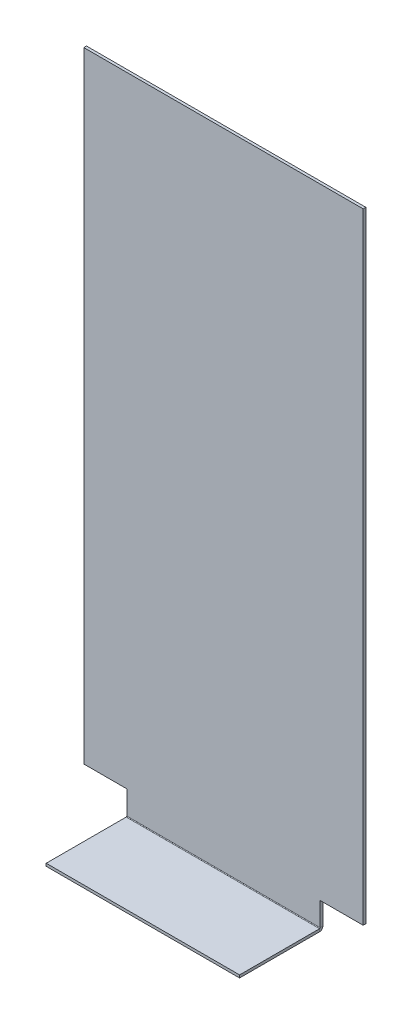
ISO-10303-21;
HEADER;
FILE_DESCRIPTION(('STEP AP214'),'2;1');
FILE_NAME('part.step','',(''),(''),'','','');
FILE_SCHEMA(('AUTOMOTIVE_DESIGN { 1 0 10303 214 1 1 1 1 }'));
ENDSEC;
DATA;
#1=APPLICATION_CONTEXT('core data for automotive mechanical design processes');
#2=APPLICATION_PROTOCOL_DEFINITION('international standard','automotive_design',2000,#1);
#3=PRODUCT_CONTEXT('',#1,'mechanical');
#4=PRODUCT('Part','Part','',(#3));
#5=PRODUCT_RELATED_PRODUCT_CATEGORY('part','',(#4));
#6=PRODUCT_DEFINITION_FORMATION('','',#4);
#7=PRODUCT_DEFINITION_CONTEXT('part definition',#1,'design');
#8=PRODUCT_DEFINITION('design','',#6,#7);
#9=PRODUCT_DEFINITION_SHAPE('','',#8);
#10=(LENGTH_UNIT() NAMED_UNIT(*) SI_UNIT(.MILLI.,.METRE.));
#11=(NAMED_UNIT(*) PLANE_ANGLE_UNIT() SI_UNIT($,.RADIAN.));
#12=(NAMED_UNIT(*) SI_UNIT($,.STERADIAN.) SOLID_ANGLE_UNIT());
#13=UNCERTAINTY_MEASURE_WITH_UNIT(LENGTH_MEASURE(1.E-05),#10,'distance_accuracy_value','');
#14=(GEOMETRIC_REPRESENTATION_CONTEXT(3) GLOBAL_UNCERTAINTY_ASSIGNED_CONTEXT((#13)) GLOBAL_UNIT_ASSIGNED_CONTEXT((#10,
#11,#12)) REPRESENTATION_CONTEXT('',''));
#15=CARTESIAN_POINT('',(0.,0.,0.));
#16=DIRECTION('',(0.,0.,1.));
#17=DIRECTION('',(1.,0.,0.));
#18=AXIS2_PLACEMENT_3D('',#15,#16,#17);
#19=CARTESIAN_POINT('',(114.3,0.7366,0.));
#20=DIRECTION('',(1.,0.,0.));
#21=DIRECTION('',(0.,0.,-1.));
#22=AXIS2_PLACEMENT_3D('',#19,#20,#21);
#23=PLANE('',#22);
#24=DIRECTION('',(0.,0.,-1.));
#25=VECTOR('',#24,1.);
#26=CARTESIAN_POINT('',(114.3,0.7366,0.));
#27=LINE('',#26,#25);
#28=CARTESIAN_POINT('',(114.3,0.7366,0.));
#29=VERTEX_POINT('',#28);
#30=CARTESIAN_POINT('',(114.3,0.7366,-3.175));
#31=VERTEX_POINT('',#30);
#32=EDGE_CURVE('E11',#29,#31,#27,.T.);
#33=ORIENTED_EDGE('',*,*,#32,.F.);
#34=CARTESIAN_POINT('',(114.3,0.7366,0.736600000000002));
#35=DIRECTION('',(-1.,0.,0.));
#36=DIRECTION('',(0.,0.,1.));
#37=AXIS2_PLACEMENT_3D('',#34,#35,#36);
#38=CIRCLE('',#37,0.7366);
#39=CARTESIAN_POINT('',(114.3,0.,0.736600000000004));
#40=VERTEX_POINT('',#39);
#41=EDGE_CURVE('E132',#40,#29,#38,.F.);
#42=ORIENTED_EDGE('',*,*,#41,.F.);
#43=DIRECTION('',(0.,1.,0.));
#44=VECTOR('',#43,1.);
#45=CARTESIAN_POINT('',(114.3,-3.175,0.736600000000013));
#46=LINE('',#45,#44);
#47=CARTESIAN_POINT('',(114.3,-3.175,0.736600000000013));
#48=VERTEX_POINT('',#47);
#49=EDGE_CURVE('E51',#48,#40,#46,.T.);
#50=ORIENTED_EDGE('',*,*,#49,.F.);
#51=CARTESIAN_POINT('',(114.3,0.7366,0.736600000000002));
#52=DIRECTION('',(1.,0.,0.));
#53=DIRECTION('',(0.,0.,-1.));
#54=AXIS2_PLACEMENT_3D('',#51,#52,#53);
#55=CIRCLE('',#54,3.9116);
#56=EDGE_CURVE('E125',#48,#31,#55,.T.);
#57=ORIENTED_EDGE('',*,*,#56,.T.);
#58=EDGE_LOOP('',(#33,#42,#50,#57));
#59=FACE_BOUND('',#58,.T.);
#60=ADVANCED_FACE('F43',(#59),#23,.T.);
#61=CARTESIAN_POINT('',(114.3,-3.175,0.736600000000013));
#62=DIRECTION('',(1.,0.,0.));
#63=DIRECTION('',(0.,0.,-1.));
#64=AXIS2_PLACEMENT_3D('',#61,#62,#63);
#65=PLANE('',#64);
#66=DIRECTION('',(0.,0.,-1.));
#67=VECTOR('',#66,1.);
#68=CARTESIAN_POINT('',(114.3,28.575,0.));
#69=LINE('',#68,#67);
#70=CARTESIAN_POINT('',(114.3,28.575,0.));
#71=VERTEX_POINT('',#70);
#72=CARTESIAN_POINT('',(114.3,28.575,-3.175));
#73=VERTEX_POINT('',#72);
#74=EDGE_CURVE('E142',#71,#73,#69,.T.);
#75=ORIENTED_EDGE('',*,*,#74,.F.);
#76=DIRECTION('',(0.,1.,0.));
#77=VECTOR('',#76,1.);
#78=CARTESIAN_POINT('',(114.3,0.,0.));
#79=LINE('',#78,#77);
#80=EDGE_CURVE('E179',#29,#71,#79,.T.);
#81=ORIENTED_EDGE('',*,*,#80,.F.);
#82=ORIENTED_EDGE('',*,*,#32,.T.);
#83=DIRECTION('',(0.,1.,0.));
#84=VECTOR('',#83,1.);
#85=CARTESIAN_POINT('',(114.3,0.,-3.175));
#86=LINE('',#85,#84);
#87=EDGE_CURVE('E154',#31,#73,#86,.T.);
#88=ORIENTED_EDGE('',*,*,#87,.T.);
#89=EDGE_LOOP('',(#75,#81,#82,#88));
#90=FACE_BOUND('',#89,.T.);
#91=ADVANCED_FACE('F187',(#90),#65,.T.);
#92=CARTESIAN_POINT('',(-114.3,0.,0.736600000000004));
#93=DIRECTION('',(-1.,0.,0.));
#94=DIRECTION('',(0.,0.,1.));
#95=AXIS2_PLACEMENT_3D('',#92,#93,#94);
#96=PLANE('',#95);
#97=DIRECTION('',(0.,-1.,0.));
#98=VECTOR('',#97,1.);
#99=CARTESIAN_POINT('',(-114.3,0.,0.736600000000004));
#100=LINE('',#99,#98);
#101=CARTESIAN_POINT('',(-114.3,0.,0.736600000000004));
#102=VERTEX_POINT('',#101);
#103=CARTESIAN_POINT('',(-114.3,-3.175,0.736600000000013));
#104=VERTEX_POINT('',#103);
#105=EDGE_CURVE('E81',#102,#104,#100,.T.);
#106=ORIENTED_EDGE('',*,*,#105,.F.);
#107=CARTESIAN_POINT('',(-114.3,0.7366,0.736600000000002));
#108=DIRECTION('',(-1.,0.,0.));
#109=DIRECTION('',(0.,0.,1.));
#110=AXIS2_PLACEMENT_3D('',#107,#108,#109);
#111=CIRCLE('',#110,0.7366);
#112=CARTESIAN_POINT('',(-114.3,0.7366,0.));
#113=VERTEX_POINT('',#112);
#114=EDGE_CURVE('E145',#102,#113,#111,.F.);
#115=ORIENTED_EDGE('',*,*,#114,.T.);
#116=DIRECTION('',(0.,0.,1.));
#117=VECTOR('',#116,1.);
#118=CARTESIAN_POINT('',(-114.3,0.7366,-3.175));
#119=LINE('',#118,#117);
#120=CARTESIAN_POINT('',(-114.3,0.7366,-3.175));
#121=VERTEX_POINT('',#120);
#122=EDGE_CURVE('E88',#121,#113,#119,.T.);
#123=ORIENTED_EDGE('',*,*,#122,.F.);
#124=CARTESIAN_POINT('',(-114.3,0.7366,0.736600000000002));
#125=DIRECTION('',(1.,0.,0.));
#126=DIRECTION('',(0.,0.,-1.));
#127=AXIS2_PLACEMENT_3D('',#124,#125,#126);
#128=CIRCLE('',#127,3.9116);
#129=EDGE_CURVE('E152',#104,#121,#128,.T.);
#130=ORIENTED_EDGE('',*,*,#129,.F.);
#131=EDGE_LOOP('',(#106,#115,#123,#130));
#132=FACE_BOUND('',#131,.T.);
#133=ADVANCED_FACE('F185',(#132),#96,.T.);
#134=CARTESIAN_POINT('',(-114.3,0.7366,-3.175));
#135=DIRECTION('',(-1.,0.,0.));
#136=DIRECTION('',(0.,0.,1.));
#137=AXIS2_PLACEMENT_3D('',#134,#135,#136);
#138=PLANE('',#137);
#139=DIRECTION('',(0.,0.,-1.));
#140=VECTOR('',#139,1.);
#141=CARTESIAN_POINT('',(-114.3,0.,95.25));
#142=LINE('',#141,#140);
#143=CARTESIAN_POINT('',(-114.3,0.,95.25));
#144=VERTEX_POINT('',#143);
#145=EDGE_CURVE('E147',#144,#102,#142,.T.);
#146=ORIENTED_EDGE('',*,*,#145,.T.);
#147=ORIENTED_EDGE('',*,*,#105,.T.);
#148=DIRECTION('',(0.,0.,-1.));
#149=VECTOR('',#148,1.);
#150=CARTESIAN_POINT('',(-114.3,-3.175,95.25));
#151=LINE('',#150,#149);
#152=CARTESIAN_POINT('',(-114.3,-3.175,95.25));
#153=VERTEX_POINT('',#152);
#154=EDGE_CURVE('E150',#153,#104,#151,.T.);
#155=ORIENTED_EDGE('',*,*,#154,.F.);
#156=DIRECTION('',(0.,1.,0.));
#157=VECTOR('',#156,1.);
#158=CARTESIAN_POINT('',(-114.3,-3.175,95.25));
#159=LINE('',#158,#157);
#160=EDGE_CURVE('E113',#153,#144,#159,.T.);
#161=ORIENTED_EDGE('',*,*,#160,.T.);
#162=EDGE_LOOP('',(#146,#147,#155,#161));
#163=FACE_BOUND('',#162,.T.);
#164=ADVANCED_FACE('F181',(#163),#138,.T.);
#165=CARTESIAN_POINT('',(114.3,0.,-3.175));
#166=DIRECTION('',(0.,0.,1.));
#167=DIRECTION('',(1.,0.,0.));
#168=AXIS2_PLACEMENT_3D('',#165,#166,#167);
#169=PLANE('',#168);
#170=DIRECTION('',(0.,1.,0.));
#171=VECTOR('',#170,1.);
#172=CARTESIAN_POINT('',(-114.3,0.,-3.175));
#173=LINE('',#172,#171);
#174=CARTESIAN_POINT('',(-114.3,28.575,-3.175));
#175=VERTEX_POINT('',#174);
#176=EDGE_CURVE('E138',#121,#175,#173,.T.);
#177=ORIENTED_EDGE('',*,*,#176,.T.);
#178=DIRECTION('',(-1.,0.,0.));
#179=VECTOR('',#178,1.);
#180=CARTESIAN_POINT('',(-114.3,28.575,-3.175));
#181=LINE('',#180,#179);
#182=CARTESIAN_POINT('',(-165.1,28.575,-3.175));
#183=VERTEX_POINT('',#182);
#184=EDGE_CURVE('E434',#175,#183,#181,.T.);
#185=ORIENTED_EDGE('',*,*,#184,.T.);
#186=DIRECTION('',(0.,1.,0.));
#187=VECTOR('',#186,1.);
#188=CARTESIAN_POINT('',(-165.1,762.,-3.175));
#189=LINE('',#188,#187);
#190=CARTESIAN_POINT('',(-165.1,762.,-3.175));
#191=VERTEX_POINT('',#190);
#192=EDGE_CURVE('E430',#183,#191,#189,.T.);
#193=ORIENTED_EDGE('',*,*,#192,.T.);
#194=DIRECTION('',(-1.,0.,0.));
#195=VECTOR('',#194,1.);
#196=CARTESIAN_POINT('',(114.3,762.,-3.175));
#197=LINE('',#196,#195);
#198=CARTESIAN_POINT('',(165.1,762.,-3.175));
#199=VERTEX_POINT('',#198);
#200=EDGE_CURVE('E168',#199,#191,#197,.T.);
#201=ORIENTED_EDGE('',*,*,#200,.F.);
#202=DIRECTION('',(0.,-1.,0.));
#203=VECTOR('',#202,1.);
#204=CARTESIAN_POINT('',(165.1,762.,-3.175));
#205=LINE('',#204,#203);
#206=CARTESIAN_POINT('',(165.1,28.575,-3.175));
#207=VERTEX_POINT('',#206);
#208=EDGE_CURVE('E396',#199,#207,#205,.T.);
#209=ORIENTED_EDGE('',*,*,#208,.T.);
#210=DIRECTION('',(-1.,0.,0.));
#211=VECTOR('',#210,1.);
#212=CARTESIAN_POINT('',(114.3,28.575,-3.175));
#213=LINE('',#212,#211);
#214=EDGE_CURVE('E410',#207,#73,#213,.T.);
#215=ORIENTED_EDGE('',*,*,#214,.T.);
#216=ORIENTED_EDGE('',*,*,#87,.F.);
#217=DIRECTION('',(-1.,0.,0.));
#218=VECTOR('',#217,1.);
#219=CARTESIAN_POINT('',(114.3,0.7366,-3.175));
#220=LINE('',#219,#218);
#221=EDGE_CURVE('E137',#31,#121,#220,.T.);
#222=ORIENTED_EDGE('',*,*,#221,.T.);
#223=EDGE_LOOP('',(#177,#185,#193,#201,#209,#215,#216,#222));
#224=FACE_BOUND('',#223,.T.);
#225=ADVANCED_FACE('F193',(#224),#169,.F.);
#226=CARTESIAN_POINT('',(114.3,762.,0.));
#227=DIRECTION('',(0.,1.,0.));
#228=DIRECTION('',(0.,0.,1.));
#229=AXIS2_PLACEMENT_3D('',#226,#227,#228);
#230=PLANE('',#229);
#231=ORIENTED_EDGE('',*,*,#200,.T.);
#232=DIRECTION('',(0.,0.,-1.));
#233=VECTOR('',#232,1.);
#234=CARTESIAN_POINT('',(-165.1,762.,0.));
#235=LINE('',#234,#233);
#236=CARTESIAN_POINT('',(-165.1,762.,0.));
#237=VERTEX_POINT('',#236);
#238=EDGE_CURVE('E411',#237,#191,#235,.T.);
#239=ORIENTED_EDGE('',*,*,#238,.F.);
#240=DIRECTION('',(-1.,0.,0.));
#241=VECTOR('',#240,1.);
#242=CARTESIAN_POINT('',(114.3,762.,0.));
#243=LINE('',#242,#241);
#244=CARTESIAN_POINT('',(165.1,762.,0.));
#245=VERTEX_POINT('',#244);
#246=EDGE_CURVE('E165',#245,#237,#243,.T.);
#247=ORIENTED_EDGE('',*,*,#246,.F.);
#248=DIRECTION('',(0.,0.,-1.));
#249=VECTOR('',#248,1.);
#250=CARTESIAN_POINT('',(165.1,762.,0.));
#251=LINE('',#250,#249);
#252=EDGE_CURVE('E400',#245,#199,#251,.T.);
#253=ORIENTED_EDGE('',*,*,#252,.T.);
#254=EDGE_LOOP('',(#231,#239,#247,#253));
#255=FACE_BOUND('',#254,.T.);
#256=ADVANCED_FACE('F231',(#255),#230,.T.);
#257=CARTESIAN_POINT('',(114.3,0.,0.));
#258=DIRECTION('',(0.,0.,1.));
#259=DIRECTION('',(1.,0.,0.));
#260=AXIS2_PLACEMENT_3D('',#257,#258,#259);
#261=PLANE('',#260);
#262=DIRECTION('',(0.,1.,0.));
#263=VECTOR('',#262,1.);
#264=CARTESIAN_POINT('',(-114.3,0.,0.));
#265=LINE('',#264,#263);
#266=CARTESIAN_POINT('',(-114.3,28.575,0.));
#267=VERTEX_POINT('',#266);
#268=EDGE_CURVE('E141',#113,#267,#265,.T.);
#269=ORIENTED_EDGE('',*,*,#268,.F.);
#270=DIRECTION('',(-1.,0.,0.));
#271=VECTOR('',#270,1.);
#272=CARTESIAN_POINT('',(114.3,0.7366,0.));
#273=LINE('',#272,#271);
#274=EDGE_CURVE('E162',#29,#113,#273,.T.);
#275=ORIENTED_EDGE('',*,*,#274,.F.);
#276=ORIENTED_EDGE('',*,*,#80,.T.);
#277=DIRECTION('',(-1.,0.,0.));
#278=VECTOR('',#277,1.);
#279=CARTESIAN_POINT('',(114.3,28.575,0.));
#280=LINE('',#279,#278);
#281=CARTESIAN_POINT('',(165.1,28.575,0.));
#282=VERTEX_POINT('',#281);
#283=EDGE_CURVE('E419',#282,#71,#280,.T.);
#284=ORIENTED_EDGE('',*,*,#283,.F.);
#285=DIRECTION('',(0.,-1.,0.));
#286=VECTOR('',#285,1.);
#287=CARTESIAN_POINT('',(165.1,762.,0.));
#288=LINE('',#287,#286);
#289=EDGE_CURVE('E413',#245,#282,#288,.T.);
#290=ORIENTED_EDGE('',*,*,#289,.F.);
#291=ORIENTED_EDGE('',*,*,#246,.T.);
#292=DIRECTION('',(0.,1.,0.));
#293=VECTOR('',#292,1.);
#294=CARTESIAN_POINT('',(-165.1,762.,0.));
#295=LINE('',#294,#293);
#296=CARTESIAN_POINT('',(-165.1,28.575,0.));
#297=VERTEX_POINT('',#296);
#298=EDGE_CURVE('E429',#297,#237,#295,.T.);
#299=ORIENTED_EDGE('',*,*,#298,.F.);
#300=DIRECTION('',(-1.,0.,0.));
#301=VECTOR('',#300,1.);
#302=CARTESIAN_POINT('',(-114.3,28.575,0.));
#303=LINE('',#302,#301);
#304=EDGE_CURVE('E426',#267,#297,#303,.T.);
#305=ORIENTED_EDGE('',*,*,#304,.F.);
#306=EDGE_LOOP('',(#269,#275,#276,#284,#290,#291,#299,#305));
#307=FACE_BOUND('',#306,.T.);
#308=ADVANCED_FACE('F246',(#307),#261,.T.);
#309=CARTESIAN_POINT('',(114.3,0.7366,0.736600000000002));
#310=DIRECTION('',(-1.,0.,0.));
#311=DIRECTION('',(0.,0.,1.));
#312=AXIS2_PLACEMENT_3D('',#309,#310,#311);
#313=CYLINDRICAL_SURFACE('',#312,0.7366);
#314=ORIENTED_EDGE('',*,*,#114,.F.);
#315=DIRECTION('',(-1.,0.,0.));
#316=VECTOR('',#315,1.);
#317=CARTESIAN_POINT('',(114.3,0.,0.736600000000004));
#318=LINE('',#317,#316);
#319=EDGE_CURVE('E159',#40,#102,#318,.T.);
#320=ORIENTED_EDGE('',*,*,#319,.F.);
#321=ORIENTED_EDGE('',*,*,#41,.T.);
#322=ORIENTED_EDGE('',*,*,#274,.T.);
#323=EDGE_LOOP('',(#314,#320,#321,#322));
#324=FACE_BOUND('',#323,.T.);
#325=ADVANCED_FACE('F176',(#324),#313,.F.);
#326=CARTESIAN_POINT('',(114.3,0.,95.25));
#327=DIRECTION('',(0.,1.,0.));
#328=DIRECTION('',(0.,0.,1.));
#329=AXIS2_PLACEMENT_3D('',#326,#327,#328);
#330=PLANE('',#329);
#331=ORIENTED_EDGE('',*,*,#145,.F.);
#332=DIRECTION('',(-1.,0.,0.));
#333=VECTOR('',#332,1.);
#334=CARTESIAN_POINT('',(114.3,0.,95.25));
#335=LINE('',#334,#333);
#336=CARTESIAN_POINT('',(114.3,0.,95.25));
#337=VERTEX_POINT('',#336);
#338=EDGE_CURVE('E115',#337,#144,#335,.T.);
#339=ORIENTED_EDGE('',*,*,#338,.F.);
#340=DIRECTION('',(0.,0.,-1.));
#341=VECTOR('',#340,1.);
#342=CARTESIAN_POINT('',(114.3,0.,95.25));
#343=LINE('',#342,#341);
#344=EDGE_CURVE('E130',#337,#40,#343,.T.);
#345=ORIENTED_EDGE('',*,*,#344,.T.);
#346=ORIENTED_EDGE('',*,*,#319,.T.);
#347=EDGE_LOOP('',(#331,#339,#345,#346));
#348=FACE_BOUND('',#347,.T.);
#349=ADVANCED_FACE('F180',(#348),#330,.T.);
#350=CARTESIAN_POINT('',(114.3,-3.175,95.25));
#351=DIRECTION('',(0.,0.,1.));
#352=DIRECTION('',(1.,0.,0.));
#353=AXIS2_PLACEMENT_3D('',#350,#351,#352);
#354=PLANE('',#353);
#355=ORIENTED_EDGE('',*,*,#160,.F.);
#356=DIRECTION('',(-1.,0.,0.));
#357=VECTOR('',#356,1.);
#358=CARTESIAN_POINT('',(114.3,-3.175,95.25));
#359=LINE('',#358,#357);
#360=CARTESIAN_POINT('',(114.3,-3.175,95.25));
#361=VERTEX_POINT('',#360);
#362=EDGE_CURVE('E107',#361,#153,#359,.T.);
#363=ORIENTED_EDGE('',*,*,#362,.F.);
#364=DIRECTION('',(0.,1.,0.));
#365=VECTOR('',#364,1.);
#366=CARTESIAN_POINT('',(114.3,-3.175,95.25));
#367=LINE('',#366,#365);
#368=EDGE_CURVE('E111',#361,#337,#367,.T.);
#369=ORIENTED_EDGE('',*,*,#368,.T.);
#370=ORIENTED_EDGE('',*,*,#338,.T.);
#371=EDGE_LOOP('',(#355,#363,#369,#370));
#372=FACE_BOUND('',#371,.T.);
#373=ADVANCED_FACE('F109',(#372),#354,.T.);
#374=CARTESIAN_POINT('',(114.3,-3.175,95.25));
#375=DIRECTION('',(0.,1.,0.));
#376=DIRECTION('',(0.,0.,1.));
#377=AXIS2_PLACEMENT_3D('',#374,#375,#376);
#378=PLANE('',#377);
#379=ORIENTED_EDGE('',*,*,#154,.T.);
#380=DIRECTION('',(-1.,0.,0.));
#381=VECTOR('',#380,1.);
#382=CARTESIAN_POINT('',(114.3,-3.175,0.736600000000013));
#383=LINE('',#382,#381);
#384=EDGE_CURVE('E116',#48,#104,#383,.T.);
#385=ORIENTED_EDGE('',*,*,#384,.F.);
#386=DIRECTION('',(0.,0.,-1.));
#387=VECTOR('',#386,1.);
#388=CARTESIAN_POINT('',(114.3,-3.175,95.25));
#389=LINE('',#388,#387);
#390=EDGE_CURVE('E120',#361,#48,#389,.T.);
#391=ORIENTED_EDGE('',*,*,#390,.F.);
#392=ORIENTED_EDGE('',*,*,#362,.T.);
#393=EDGE_LOOP('',(#379,#385,#391,#392));
#394=FACE_BOUND('',#393,.T.);
#395=ADVANCED_FACE('F121',(#394),#378,.F.);
#396=CARTESIAN_POINT('',(114.3,0.7366,0.736600000000002));
#397=DIRECTION('',(-1.,0.,0.));
#398=DIRECTION('',(0.,0.,1.));
#399=AXIS2_PLACEMENT_3D('',#396,#397,#398);
#400=CYLINDRICAL_SURFACE('',#399,3.9116);
#401=ORIENTED_EDGE('',*,*,#129,.T.);
#402=ORIENTED_EDGE('',*,*,#221,.F.);
#403=ORIENTED_EDGE('',*,*,#56,.F.);
#404=ORIENTED_EDGE('',*,*,#384,.T.);
#405=EDGE_LOOP('',(#401,#402,#403,#404));
#406=FACE_BOUND('',#405,.T.);
#407=ADVANCED_FACE('F183',(#406),#400,.T.);
#408=CARTESIAN_POINT('',(114.3,0.7366,0.736600000000002));
#409=DIRECTION('',(-1.,0.,0.));
#410=DIRECTION('',(0.,0.,1.));
#411=AXIS2_PLACEMENT_3D('',#408,#409,#410);
#412=PLANE('',#411);
#413=ORIENTED_EDGE('',*,*,#390,.T.);
#414=ORIENTED_EDGE('',*,*,#49,.T.);
#415=ORIENTED_EDGE('',*,*,#344,.F.);
#416=ORIENTED_EDGE('',*,*,#368,.F.);
#417=EDGE_LOOP('',(#413,#414,#415,#416));
#418=FACE_BOUND('',#417,.T.);
#419=ADVANCED_FACE('F128',(#418),#412,.F.);
#420=CARTESIAN_POINT('',(-114.3,0.7366,0.736600000000002));
#421=DIRECTION('',(-1.,0.,0.));
#422=DIRECTION('',(0.,0.,1.));
#423=AXIS2_PLACEMENT_3D('',#420,#421,#422);
#424=PLANE('',#423);
#425=DIRECTION('',(0.,0.,-1.));
#426=VECTOR('',#425,1.);
#427=CARTESIAN_POINT('',(-114.3,28.575,0.));
#428=LINE('',#427,#426);
#429=EDGE_CURVE('E433',#267,#175,#428,.T.);
#430=ORIENTED_EDGE('',*,*,#429,.T.);
#431=ORIENTED_EDGE('',*,*,#176,.F.);
#432=ORIENTED_EDGE('',*,*,#122,.T.);
#433=ORIENTED_EDGE('',*,*,#268,.T.);
#434=EDGE_LOOP('',(#430,#431,#432,#433));
#435=FACE_BOUND('',#434,.T.);
#436=ADVANCED_FACE('F314',(#435),#424,.T.);
#437=CARTESIAN_POINT('',(-165.1,762.,0.));
#438=DIRECTION('',(-1.,0.,0.));
#439=DIRECTION('',(0.,0.,1.));
#440=AXIS2_PLACEMENT_3D('',#437,#438,#439);
#441=PLANE('',#440);
#442=ORIENTED_EDGE('',*,*,#192,.F.);
#443=DIRECTION('',(0.,0.,-1.));
#444=VECTOR('',#443,1.);
#445=CARTESIAN_POINT('',(-165.1,28.575,0.));
#446=LINE('',#445,#444);
#447=EDGE_CURVE('E416',#297,#183,#446,.T.);
#448=ORIENTED_EDGE('',*,*,#447,.F.);
#449=ORIENTED_EDGE('',*,*,#298,.T.);
#450=ORIENTED_EDGE('',*,*,#238,.T.);
#451=EDGE_LOOP('',(#442,#448,#449,#450));
#452=FACE_BOUND('',#451,.T.);
#453=ADVANCED_FACE('F323',(#452),#441,.T.);
#454=CARTESIAN_POINT('',(-114.3,28.575,0.));
#455=DIRECTION('',(0.,-1.,0.));
#456=DIRECTION('',(0.,0.,-1.));
#457=AXIS2_PLACEMENT_3D('',#454,#455,#456);
#458=PLANE('',#457);
#459=ORIENTED_EDGE('',*,*,#184,.F.);
#460=ORIENTED_EDGE('',*,*,#429,.F.);
#461=ORIENTED_EDGE('',*,*,#304,.T.);
#462=ORIENTED_EDGE('',*,*,#447,.T.);
#463=EDGE_LOOP('',(#459,#460,#461,#462));
#464=FACE_BOUND('',#463,.T.);
#465=ADVANCED_FACE('F335',(#464),#458,.T.);
#466=CARTESIAN_POINT('',(114.3,28.575,0.));
#467=DIRECTION('',(0.,-1.,0.));
#468=DIRECTION('',(0.,0.,-1.));
#469=AXIS2_PLACEMENT_3D('',#466,#467,#468);
#470=PLANE('',#469);
#471=ORIENTED_EDGE('',*,*,#214,.F.);
#472=DIRECTION('',(0.,0.,-1.));
#473=VECTOR('',#472,1.);
#474=CARTESIAN_POINT('',(165.1,28.575,0.));
#475=LINE('',#474,#473);
#476=EDGE_CURVE('E404',#282,#207,#475,.T.);
#477=ORIENTED_EDGE('',*,*,#476,.F.);
#478=ORIENTED_EDGE('',*,*,#283,.T.);
#479=ORIENTED_EDGE('',*,*,#74,.T.);
#480=EDGE_LOOP('',(#471,#477,#478,#479));
#481=FACE_BOUND('',#480,.T.);
#482=ADVANCED_FACE('F343',(#481),#470,.T.);
#483=CARTESIAN_POINT('',(165.1,762.,0.));
#484=DIRECTION('',(1.,0.,0.));
#485=DIRECTION('',(0.,1.,0.));
#486=AXIS2_PLACEMENT_3D('',#483,#484,#485);
#487=PLANE('',#486);
#488=ORIENTED_EDGE('',*,*,#208,.F.);
#489=ORIENTED_EDGE('',*,*,#252,.F.);
#490=ORIENTED_EDGE('',*,*,#289,.T.);
#491=ORIENTED_EDGE('',*,*,#476,.T.);
#492=EDGE_LOOP('',(#488,#489,#490,#491));
#493=FACE_BOUND('',#492,.T.);
#494=ADVANCED_FACE('F352',(#493),#487,.T.);
#495=CLOSED_SHELL('',(#60,#91,#133,#164,#225,#256,#308,#325,#349,#373,#395,#407,#419,#436,#453,
#465,#482,#494));
#496=MANIFOLD_SOLID_BREP('B2',#495);
#497=ADVANCED_BREP_SHAPE_REPRESENTATION('',(#18,#496),#14);
#498=SHAPE_DEFINITION_REPRESENTATION(#9,#497);
ENDSEC;
END-ISO-10303-21;
